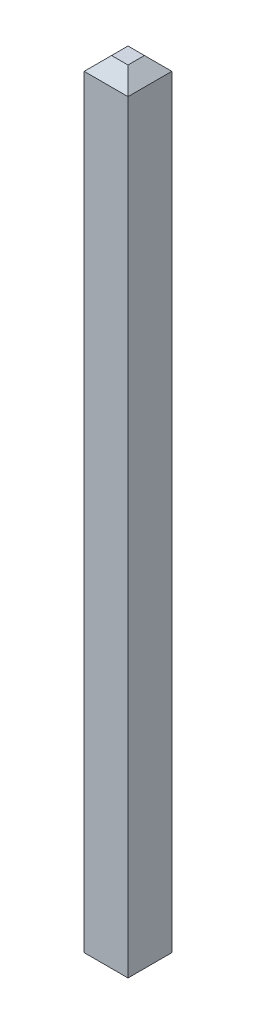
ISO-10303-21;
HEADER;
FILE_DESCRIPTION(('STEP AP214'),'2;1');
FILE_NAME('part.step','',(''),(''),'','','');
FILE_SCHEMA(('AUTOMOTIVE_DESIGN { 1 0 10303 214 1 1 1 1 }'));
ENDSEC;
DATA;
#1=APPLICATION_CONTEXT('core data for automotive mechanical design processes');
#2=APPLICATION_PROTOCOL_DEFINITION('international standard','automotive_design',2000,#1);
#3=PRODUCT_CONTEXT('',#1,'mechanical');
#4=PRODUCT('Part','Part','',(#3));
#5=PRODUCT_RELATED_PRODUCT_CATEGORY('part','',(#4));
#6=PRODUCT_DEFINITION_FORMATION('','',#4);
#7=PRODUCT_DEFINITION_CONTEXT('part definition',#1,'design');
#8=PRODUCT_DEFINITION('design','',#6,#7);
#9=PRODUCT_DEFINITION_SHAPE('','',#8);
#10=(LENGTH_UNIT() NAMED_UNIT(*) SI_UNIT(.MILLI.,.METRE.));
#11=(NAMED_UNIT(*) PLANE_ANGLE_UNIT() SI_UNIT($,.RADIAN.));
#12=(NAMED_UNIT(*) SI_UNIT($,.STERADIAN.) SOLID_ANGLE_UNIT());
#13=UNCERTAINTY_MEASURE_WITH_UNIT(LENGTH_MEASURE(1.E-05),#10,'distance_accuracy_value','');
#14=(GEOMETRIC_REPRESENTATION_CONTEXT(3) GLOBAL_UNCERTAINTY_ASSIGNED_CONTEXT((#13)) GLOBAL_UNIT_ASSIGNED_CONTEXT((#10,
#11,#12)) REPRESENTATION_CONTEXT('',''));
#15=CARTESIAN_POINT('',(0.,0.,0.));
#16=DIRECTION('',(0.,0.,1.));
#17=DIRECTION('',(1.,0.,0.));
#18=AXIS2_PLACEMENT_3D('',#15,#16,#17);
#19=CARTESIAN_POINT('',(-8.57,7.07,-0.32));
#20=DIRECTION('',(-0.707106781186548,-0.707106781186548,0.));
#21=DIRECTION('',(-0.707106781186548,0.707106781186548,0.));
#22=AXIS2_PLACEMENT_3D('',#19,#20,#21);
#23=PLANE('',#22);
#24=DIRECTION('',(0.577350269189626,-0.577350269189626,0.577350269189626));
#25=VECTOR('',#24,1.);
#26=CARTESIAN_POINT('',(-8.783333333333,7.283333333333,0.106666666667));
#27=LINE('',#26,#25);
#28=CARTESIAN_POINT('',(-8.77,7.27,0.12));
#29=VERTEX_POINT('',#28);
#30=CARTESIAN_POINT('',(-8.57,7.07,0.32));
#31=VERTEX_POINT('',#30);
#32=EDGE_CURVE('E184',#29,#31,#27,.T.);
#33=ORIENTED_EDGE('',*,*,#32,.T.);
#34=DIRECTION('',(0.,0.,1.));
#35=VECTOR('',#34,1.);
#36=CARTESIAN_POINT('',(-8.57,7.07,-0.32));
#37=LINE('',#36,#35);
#38=CARTESIAN_POINT('',(-8.57,7.07,-0.32));
#39=VERTEX_POINT('',#38);
#40=EDGE_CURVE('E110',#39,#31,#37,.T.);
#41=ORIENTED_EDGE('',*,*,#40,.F.);
#42=DIRECTION('',(0.577350269189626,-0.577350269189626,-0.577350269189626));
#43=VECTOR('',#42,1.);
#44=CARTESIAN_POINT('',(-8.57,7.07,-0.32));
#45=LINE('',#44,#43);
#46=CARTESIAN_POINT('',(-8.77,7.27,-0.12));
#47=VERTEX_POINT('',#46);
#48=EDGE_CURVE('E11',#47,#39,#45,.T.);
#49=ORIENTED_EDGE('',*,*,#48,.F.);
#50=DIRECTION('',(0.,0.,-1.));
#51=VECTOR('',#50,1.);
#52=CARTESIAN_POINT('',(-8.77,7.27,-0.32));
#53=LINE('',#52,#51);
#54=EDGE_CURVE('E172',#29,#47,#53,.T.);
#55=ORIENTED_EDGE('',*,*,#54,.F.);
#56=EDGE_LOOP('',(#33,#41,#49,#55));
#57=FACE_BOUND('',#56,.T.);
#58=ADVANCED_FACE('F17',(#57),#23,.F.);
#59=CARTESIAN_POINT('',(-8.89,7.07,-0.32));
#60=DIRECTION('',(0.,0.707106781186548,-0.707106781186548));
#61=DIRECTION('',(-1.,0.,0.));
#62=AXIS2_PLACEMENT_3D('',#59,#60,#61);
#63=PLANE('',#62);
#64=DIRECTION('',(0.577350269189626,0.577350269189626,0.577350269189626));
#65=VECTOR('',#64,1.);
#66=CARTESIAN_POINT('',(-9.076666666667,7.203333333333,-0.186666666667));
#67=LINE('',#66,#65);
#68=CARTESIAN_POINT('',(-9.21,7.07,-0.32));
#69=VERTEX_POINT('',#68);
#70=CARTESIAN_POINT('',(-9.01,7.27,-0.12));
#71=VERTEX_POINT('',#70);
#72=EDGE_CURVE('E25',#69,#71,#67,.T.);
#73=ORIENTED_EDGE('',*,*,#72,.T.);
#74=DIRECTION('',(-1.,0.,0.));
#75=VECTOR('',#74,1.);
#76=CARTESIAN_POINT('',(-9.21,7.27,-0.12));
#77=LINE('',#76,#75);
#78=EDGE_CURVE('E176',#47,#71,#77,.T.);
#79=ORIENTED_EDGE('',*,*,#78,.F.);
#80=ORIENTED_EDGE('',*,*,#48,.T.);
#81=DIRECTION('',(1.,0.,0.));
#82=VECTOR('',#81,1.);
#83=CARTESIAN_POINT('',(-8.57,7.07,-0.32));
#84=LINE('',#83,#82);
#85=EDGE_CURVE('E162',#69,#39,#84,.T.);
#86=ORIENTED_EDGE('',*,*,#85,.F.);
#87=EDGE_LOOP('',(#73,#79,#80,#86));
#88=FACE_BOUND('',#87,.T.);
#89=ADVANCED_FACE('F267',(#88),#63,.T.);
#90=CARTESIAN_POINT('',(-9.01,7.27,-0.32));
#91=DIRECTION('',(0.707106781186548,-0.707106781186548,0.));
#92=DIRECTION('',(0.,0.,-1.));
#93=AXIS2_PLACEMENT_3D('',#90,#91,#92);
#94=PLANE('',#93);
#95=DIRECTION('',(-0.577350269189626,-0.577350269189626,0.577350269189626));
#96=VECTOR('',#95,1.);
#97=CARTESIAN_POINT('',(-9.076666666667,7.203333333333,0.186666666667));
#98=LINE('',#97,#96);
#99=CARTESIAN_POINT('',(-9.01,7.27,0.12));
#100=VERTEX_POINT('',#99);
#101=CARTESIAN_POINT('',(-9.21,7.07,0.32));
#102=VERTEX_POINT('',#101);
#103=EDGE_CURVE('E37',#100,#102,#98,.T.);
#104=ORIENTED_EDGE('',*,*,#103,.F.);
#105=DIRECTION('',(0.,0.,1.));
#106=VECTOR('',#105,1.);
#107=CARTESIAN_POINT('',(-9.01,7.27,-0.32));
#108=LINE('',#107,#106);
#109=EDGE_CURVE('E153',#71,#100,#108,.T.);
#110=ORIENTED_EDGE('',*,*,#109,.F.);
#111=ORIENTED_EDGE('',*,*,#72,.F.);
#112=DIRECTION('',(0.,0.,-1.));
#113=VECTOR('',#112,1.);
#114=CARTESIAN_POINT('',(-9.21,7.07,-0.32));
#115=LINE('',#114,#113);
#116=EDGE_CURVE('E157',#102,#69,#115,.T.);
#117=ORIENTED_EDGE('',*,*,#116,.F.);
#118=EDGE_LOOP('',(#104,#110,#111,#117));
#119=FACE_BOUND('',#118,.T.);
#120=ADVANCED_FACE('F261',(#119),#94,.F.);
#121=CARTESIAN_POINT('',(-9.21,7.27,0.12));
#122=DIRECTION('',(0.,-0.707106781186548,-0.707106781186548));
#123=DIRECTION('',(0.,-0.707106781186548,0.707106781186548));
#124=AXIS2_PLACEMENT_3D('',#121,#122,#123);
#125=PLANE('',#124);
#126=ORIENTED_EDGE('',*,*,#32,.F.);
#127=DIRECTION('',(1.,0.,0.));
#128=VECTOR('',#127,1.);
#129=CARTESIAN_POINT('',(-9.21,7.27,0.12));
#130=LINE('',#129,#128);
#131=EDGE_CURVE('E180',#100,#29,#130,.T.);
#132=ORIENTED_EDGE('',*,*,#131,.F.);
#133=ORIENTED_EDGE('',*,*,#103,.T.);
#134=DIRECTION('',(-1.,0.,0.));
#135=VECTOR('',#134,1.);
#136=CARTESIAN_POINT('',(-8.89,7.07,0.32));
#137=LINE('',#136,#135);
#138=EDGE_CURVE('E116',#31,#102,#137,.T.);
#139=ORIENTED_EDGE('',*,*,#138,.F.);
#140=EDGE_LOOP('',(#126,#132,#133,#139));
#141=FACE_BOUND('',#140,.T.);
#142=ADVANCED_FACE('F266',(#141),#125,.F.);
#143=CARTESIAN_POINT('',(-9.21,7.27,-0.32));
#144=DIRECTION('',(0.,-1.,0.));
#145=DIRECTION('',(0.,0.,-1.));
#146=AXIS2_PLACEMENT_3D('',#143,#144,#145);
#147=PLANE('',#146);
#148=ORIENTED_EDGE('',*,*,#54,.T.);
#149=ORIENTED_EDGE('',*,*,#78,.T.);
#150=ORIENTED_EDGE('',*,*,#109,.T.);
#151=ORIENTED_EDGE('',*,*,#131,.T.);
#152=EDGE_LOOP('',(#148,#149,#150,#151));
#153=FACE_BOUND('',#152,.T.);
#154=ADVANCED_FACE('F296',(#153),#147,.F.);
#155=CARTESIAN_POINT('',(-8.57,7.27,-0.32));
#156=DIRECTION('',(-1.,0.,0.));
#157=DIRECTION('',(0.,1.,0.));
#158=AXIS2_PLACEMENT_3D('',#155,#156,#157);
#159=PLANE('',#158);
#160=DIRECTION('',(0.,-1.,0.));
#161=VECTOR('',#160,1.);
#162=CARTESIAN_POINT('',(-8.57,7.27,-0.32));
#163=LINE('',#162,#161);
#164=CARTESIAN_POINT('',(-8.57,-4.07,-0.32));
#165=VERTEX_POINT('',#164);
#166=EDGE_CURVE('E165',#39,#165,#163,.T.);
#167=ORIENTED_EDGE('',*,*,#166,.F.);
#168=ORIENTED_EDGE('',*,*,#40,.T.);
#169=DIRECTION('',(0.,-1.,0.));
#170=VECTOR('',#169,1.);
#171=CARTESIAN_POINT('',(-8.57,7.27,0.32));
#172=LINE('',#171,#170);
#173=CARTESIAN_POINT('',(-8.57,-4.07,0.32));
#174=VERTEX_POINT('',#173);
#175=EDGE_CURVE('E103',#31,#174,#172,.T.);
#176=ORIENTED_EDGE('',*,*,#175,.T.);
#177=DIRECTION('',(0.,0.,-1.));
#178=VECTOR('',#177,1.);
#179=CARTESIAN_POINT('',(-8.57,-4.07,-0.32));
#180=LINE('',#179,#178);
#181=EDGE_CURVE('E107',#174,#165,#180,.T.);
#182=ORIENTED_EDGE('',*,*,#181,.T.);
#183=EDGE_LOOP('',(#167,#168,#176,#182));
#184=FACE_BOUND('',#183,.T.);
#185=ADVANCED_FACE('F106',(#184),#159,.F.);
#186=CARTESIAN_POINT('',(-8.89,1.5,0.32));
#187=DIRECTION('',(0.,0.,-1.));
#188=DIRECTION('',(0.,-1.,0.));
#189=AXIS2_PLACEMENT_3D('',#186,#187,#188);
#190=PLANE('',#189);
#191=ORIENTED_EDGE('',*,*,#175,.F.);
#192=ORIENTED_EDGE('',*,*,#138,.T.);
#193=DIRECTION('',(0.,1.,0.));
#194=VECTOR('',#193,1.);
#195=CARTESIAN_POINT('',(-9.21,-4.27,0.32));
#196=LINE('',#195,#194);
#197=CARTESIAN_POINT('',(-9.21,-4.07,0.32));
#198=VERTEX_POINT('',#197);
#199=EDGE_CURVE('E133',#198,#102,#196,.T.);
#200=ORIENTED_EDGE('',*,*,#199,.F.);
#201=DIRECTION('',(1.,0.,0.));
#202=VECTOR('',#201,1.);
#203=CARTESIAN_POINT('',(-8.89,-4.07,0.32));
#204=LINE('',#203,#202);
#205=EDGE_CURVE('E128',#198,#174,#204,.T.);
#206=ORIENTED_EDGE('',*,*,#205,.T.);
#207=EDGE_LOOP('',(#191,#192,#200,#206));
#208=FACE_BOUND('',#207,.T.);
#209=ADVANCED_FACE('F131',(#208),#190,.F.);
#210=CARTESIAN_POINT('',(-8.77,-4.27,-0.32));
#211=DIRECTION('',(-0.707106781186548,0.707106781186548,0.));
#212=DIRECTION('',(0.,0.,1.));
#213=AXIS2_PLACEMENT_3D('',#210,#211,#212);
#214=PLANE('',#213);
#215=DIRECTION('',(-0.577350269189626,-0.577350269189626,0.577350269189626));
#216=VECTOR('',#215,1.);
#217=CARTESIAN_POINT('',(-8.703333333333,-4.203333333333,-0.186666666667));
#218=LINE('',#217,#216);
#219=CARTESIAN_POINT('',(-8.77,-4.27,-0.12));
#220=VERTEX_POINT('',#219);
#221=EDGE_CURVE('E125',#165,#220,#218,.T.);
#222=ORIENTED_EDGE('',*,*,#221,.F.);
#223=ORIENTED_EDGE('',*,*,#181,.F.);
#224=DIRECTION('',(-0.577350269189626,-0.577350269189626,-0.577350269189626));
#225=VECTOR('',#224,1.);
#226=CARTESIAN_POINT('',(-8.916666666667,-4.416666666667,-0.02666666666667));
#227=LINE('',#226,#225);
#228=CARTESIAN_POINT('',(-8.77,-4.27,0.12));
#229=VERTEX_POINT('',#228);
#230=EDGE_CURVE('E123',#174,#229,#227,.T.);
#231=ORIENTED_EDGE('',*,*,#230,.T.);
#232=DIRECTION('',(0.,0.,1.));
#233=VECTOR('',#232,1.);
#234=CARTESIAN_POINT('',(-8.77,-4.27,-0.32));
#235=LINE('',#234,#233);
#236=EDGE_CURVE('E376',#220,#229,#235,.T.);
#237=ORIENTED_EDGE('',*,*,#236,.F.);
#238=EDGE_LOOP('',(#222,#223,#231,#237));
#239=FACE_BOUND('',#238,.T.);
#240=ADVANCED_FACE('F120',(#239),#214,.F.);
#241=CARTESIAN_POINT('',(-8.57,-4.27,0.12));
#242=DIRECTION('',(0.,0.707106781186548,-0.707106781186548));
#243=DIRECTION('',(-1.,0.,0.));
#244=AXIS2_PLACEMENT_3D('',#241,#242,#243);
#245=PLANE('',#244);
#246=ORIENTED_EDGE('',*,*,#230,.F.);
#247=ORIENTED_EDGE('',*,*,#205,.F.);
#248=DIRECTION('',(-0.577350269189626,0.577350269189626,0.577350269189626));
#249=VECTOR('',#248,1.);
#250=CARTESIAN_POINT('',(-8.996666666667,-4.283333333333,0.106666666667));
#251=LINE('',#250,#249);
#252=CARTESIAN_POINT('',(-9.01,-4.27,0.12));
#253=VERTEX_POINT('',#252);
#254=EDGE_CURVE('E143',#253,#198,#251,.T.);
#255=ORIENTED_EDGE('',*,*,#254,.F.);
#256=DIRECTION('',(-1.,0.,0.));
#257=VECTOR('',#256,1.);
#258=CARTESIAN_POINT('',(-8.57,-4.27,0.12));
#259=LINE('',#258,#257);
#260=EDGE_CURVE('E140',#229,#253,#259,.T.);
#261=ORIENTED_EDGE('',*,*,#260,.F.);
#262=EDGE_LOOP('',(#246,#247,#255,#261));
#263=FACE_BOUND('',#262,.T.);
#264=ADVANCED_FACE('F138',(#263),#245,.F.);
#265=CARTESIAN_POINT('',(-9.21,-4.07,-0.32));
#266=DIRECTION('',(0.707106781186548,0.707106781186548,0.));
#267=DIRECTION('',(0.,0.,-1.));
#268=AXIS2_PLACEMENT_3D('',#265,#266,#267);
#269=PLANE('',#268);
#270=DIRECTION('',(0.577350269189626,-0.577350269189626,0.577350269189626));
#271=VECTOR('',#270,1.);
#272=CARTESIAN_POINT('',(-9.103333333333,-4.176666666667,-0.213333333333));
#273=LINE('',#272,#271);
#274=CARTESIAN_POINT('',(-9.21,-4.07,-0.32));
#275=VERTEX_POINT('',#274);
#276=CARTESIAN_POINT('',(-9.01,-4.27,-0.12));
#277=VERTEX_POINT('',#276);
#278=EDGE_CURVE('E366',#275,#277,#273,.T.);
#279=ORIENTED_EDGE('',*,*,#278,.T.);
#280=DIRECTION('',(0.,0.,-1.));
#281=VECTOR('',#280,1.);
#282=CARTESIAN_POINT('',(-9.01,-4.27,-0.32));
#283=LINE('',#282,#281);
#284=EDGE_CURVE('E362',#253,#277,#283,.T.);
#285=ORIENTED_EDGE('',*,*,#284,.F.);
#286=ORIENTED_EDGE('',*,*,#254,.T.);
#287=DIRECTION('',(0.,0.,1.));
#288=VECTOR('',#287,1.);
#289=CARTESIAN_POINT('',(-9.21,-4.07,-0.32));
#290=LINE('',#289,#288);
#291=EDGE_CURVE('E149',#275,#198,#290,.T.);
#292=ORIENTED_EDGE('',*,*,#291,.F.);
#293=EDGE_LOOP('',(#279,#285,#286,#292));
#294=FACE_BOUND('',#293,.T.);
#295=ADVANCED_FACE('F234',(#294),#269,.F.);
#296=CARTESIAN_POINT('',(-9.21,-4.27,-0.32));
#297=DIRECTION('',(1.,0.,0.));
#298=DIRECTION('',(0.,0.,1.));
#299=AXIS2_PLACEMENT_3D('',#296,#297,#298);
#300=PLANE('',#299);
#301=ORIENTED_EDGE('',*,*,#199,.T.);
#302=ORIENTED_EDGE('',*,*,#116,.T.);
#303=DIRECTION('',(0.,1.,0.));
#304=VECTOR('',#303,1.);
#305=CARTESIAN_POINT('',(-9.21,-4.27,-0.32));
#306=LINE('',#305,#304);
#307=EDGE_CURVE('E158',#275,#69,#306,.T.);
#308=ORIENTED_EDGE('',*,*,#307,.F.);
#309=ORIENTED_EDGE('',*,*,#291,.T.);
#310=EDGE_LOOP('',(#301,#302,#308,#309));
#311=FACE_BOUND('',#310,.T.);
#312=ADVANCED_FACE('F223',(#311),#300,.F.);
#313=CARTESIAN_POINT('',(-8.89,1.5,-0.32));
#314=DIRECTION('',(0.,0.,-1.));
#315=DIRECTION('',(0.,-1.,0.));
#316=AXIS2_PLACEMENT_3D('',#313,#314,#315);
#317=PLANE('',#316);
#318=ORIENTED_EDGE('',*,*,#307,.T.);
#319=ORIENTED_EDGE('',*,*,#85,.T.);
#320=ORIENTED_EDGE('',*,*,#166,.T.);
#321=DIRECTION('',(-1.,0.,0.));
#322=VECTOR('',#321,1.);
#323=CARTESIAN_POINT('',(-9.21,-4.07,-0.32));
#324=LINE('',#323,#322);
#325=EDGE_CURVE('E368',#165,#275,#324,.T.);
#326=ORIENTED_EDGE('',*,*,#325,.T.);
#327=EDGE_LOOP('',(#318,#319,#320,#326));
#328=FACE_BOUND('',#327,.T.);
#329=ADVANCED_FACE('F212',(#328),#317,.T.);
#330=CARTESIAN_POINT('',(-8.89,-4.07,-0.32));
#331=DIRECTION('',(0.,-0.707106781186548,-0.707106781186548));
#332=DIRECTION('',(0.,-0.707106781186548,0.707106781186548));
#333=AXIS2_PLACEMENT_3D('',#330,#331,#332);
#334=PLANE('',#333);
#335=ORIENTED_EDGE('',*,*,#278,.F.);
#336=ORIENTED_EDGE('',*,*,#325,.F.);
#337=ORIENTED_EDGE('',*,*,#221,.T.);
#338=DIRECTION('',(1.,0.,0.));
#339=VECTOR('',#338,1.);
#340=CARTESIAN_POINT('',(-8.57,-4.27,-0.12));
#341=LINE('',#340,#339);
#342=EDGE_CURVE('E364',#277,#220,#341,.T.);
#343=ORIENTED_EDGE('',*,*,#342,.F.);
#344=EDGE_LOOP('',(#335,#336,#337,#343));
#345=FACE_BOUND('',#344,.T.);
#346=ADVANCED_FACE('F199',(#345),#334,.T.);
#347=CARTESIAN_POINT('',(-8.57,-4.27,-0.32));
#348=DIRECTION('',(0.,1.,0.));
#349=DIRECTION('',(0.,0.,-1.));
#350=AXIS2_PLACEMENT_3D('',#347,#348,#349);
#351=PLANE('',#350);
#352=ORIENTED_EDGE('',*,*,#236,.T.);
#353=ORIENTED_EDGE('',*,*,#260,.T.);
#354=ORIENTED_EDGE('',*,*,#284,.T.);
#355=ORIENTED_EDGE('',*,*,#342,.T.);
#356=EDGE_LOOP('',(#352,#353,#354,#355));
#357=FACE_BOUND('',#356,.T.);
#358=ADVANCED_FACE('F193',(#357),#351,.F.);
#359=CLOSED_SHELL('',(#58,#89,#120,#142,#154,#185,#209,#240,#264,#295,#312,#329,#346,#358));
#360=MANIFOLD_SOLID_BREP('B1',#359);
#361=ADVANCED_BREP_SHAPE_REPRESENTATION('',(#18,#360),#14);
#362=SHAPE_DEFINITION_REPRESENTATION(#9,#361);
ENDSEC;
END-ISO-10303-21;
